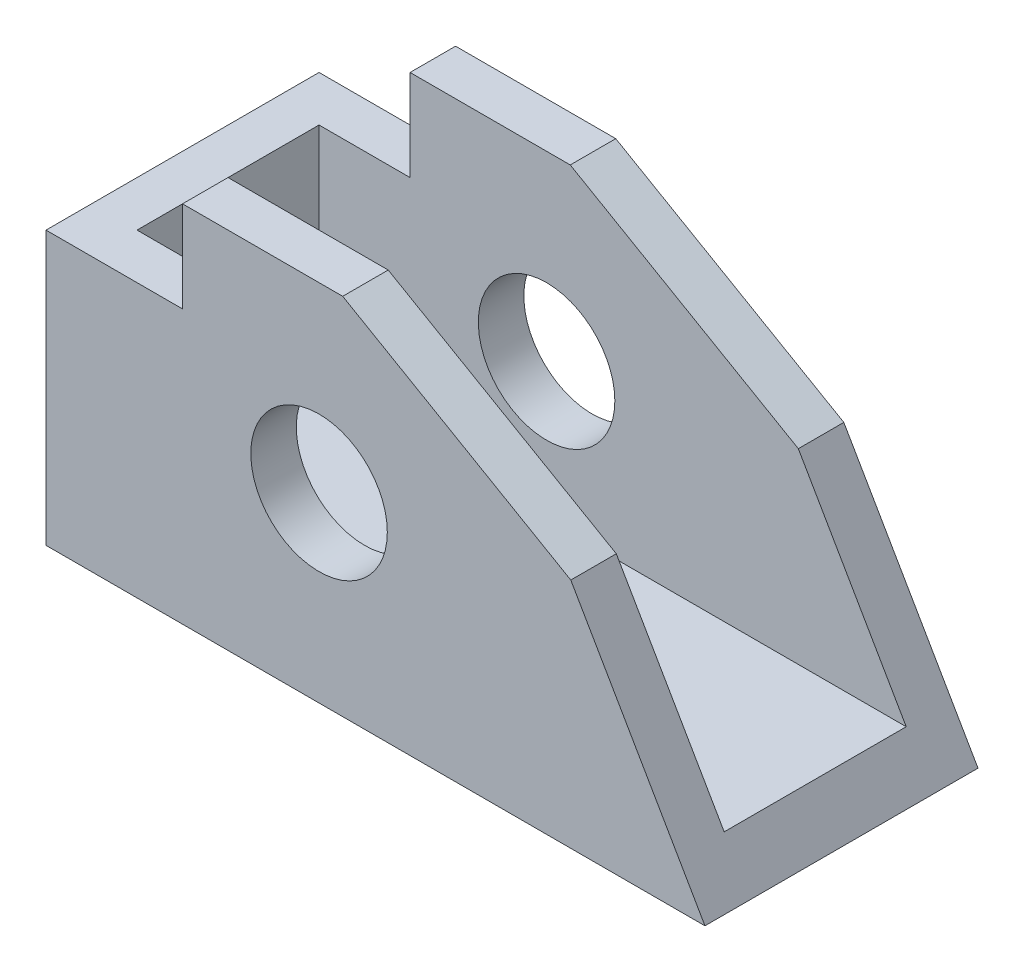
ISO-10303-21;
HEADER;
FILE_DESCRIPTION(('STEP AP214'),'2;1');
FILE_NAME('part.step','',(''),(''),'','','');
FILE_SCHEMA(('AUTOMOTIVE_DESIGN { 1 0 10303 214 1 1 1 1 }'));
ENDSEC;
DATA;
#1=APPLICATION_CONTEXT('core data for automotive mechanical design processes');
#2=APPLICATION_PROTOCOL_DEFINITION('international standard','automotive_design',2000,#1);
#3=PRODUCT_CONTEXT('',#1,'mechanical');
#4=PRODUCT('Part','Part','',(#3));
#5=PRODUCT_RELATED_PRODUCT_CATEGORY('part','',(#4));
#6=PRODUCT_DEFINITION_FORMATION('','',#4);
#7=PRODUCT_DEFINITION_CONTEXT('part definition',#1,'design');
#8=PRODUCT_DEFINITION('design','',#6,#7);
#9=PRODUCT_DEFINITION_SHAPE('','',#8);
#10=(LENGTH_UNIT() NAMED_UNIT(*) SI_UNIT(.MILLI.,.METRE.));
#11=(NAMED_UNIT(*) PLANE_ANGLE_UNIT() SI_UNIT($,.RADIAN.));
#12=(NAMED_UNIT(*) SI_UNIT($,.STERADIAN.) SOLID_ANGLE_UNIT());
#13=UNCERTAINTY_MEASURE_WITH_UNIT(LENGTH_MEASURE(1.E-05),#10,'distance_accuracy_value','');
#14=(GEOMETRIC_REPRESENTATION_CONTEXT(3) GLOBAL_UNCERTAINTY_ASSIGNED_CONTEXT((#13)) GLOBAL_UNIT_ASSIGNED_CONTEXT((#10,
#11,#12)) REPRESENTATION_CONTEXT('',''));
#15=CARTESIAN_POINT('',(0.,0.,0.));
#16=DIRECTION('',(0.,0.,1.));
#17=DIRECTION('',(1.,0.,0.));
#18=AXIS2_PLACEMENT_3D('',#15,#16,#17);
#19=CARTESIAN_POINT('',(0.,50.8,0.));
#20=DIRECTION('',(0.,1.,0.));
#21=DIRECTION('',(0.,0.,1.));
#22=AXIS2_PLACEMENT_3D('',#19,#20,#21);
#23=PLANE('',#22);
#24=DIRECTION('',(0.,0.,1.));
#25=VECTOR('',#24,1.);
#26=CARTESIAN_POINT('',(-48.9494285714286,50.8,-44.7675));
#27=LINE('',#26,#25);
#28=CARTESIAN_POINT('',(-48.9494285714286,50.8,-13.0175));
#29=VERTEX_POINT('',#28);
#30=CARTESIAN_POINT('',(-48.9494285714286,50.8,-6.66749999999999));
#31=VERTEX_POINT('',#30);
#32=EDGE_CURVE('E162',#29,#31,#27,.T.);
#33=ORIENTED_EDGE('',*,*,#32,.F.);
#34=DIRECTION('',(1.,0.,0.));
#35=VECTOR('',#34,1.);
#36=CARTESIAN_POINT('',(-84.0014285714286,50.8,-13.0175));
#37=LINE('',#36,#35);
#38=CARTESIAN_POINT('',(-71.3014285714286,50.8,-13.0175));
#39=VERTEX_POINT('',#38);
#40=EDGE_CURVE('E183',#39,#29,#37,.T.);
#41=ORIENTED_EDGE('',*,*,#40,.F.);
#42=DIRECTION('',(0.,0.,1.));
#43=VECTOR('',#42,1.);
#44=CARTESIAN_POINT('',(-71.3014285714286,50.8,-44.7675));
#45=LINE('',#44,#43);
#46=CARTESIAN_POINT('',(-71.3014285714286,50.8,-6.66749999999999));
#47=VERTEX_POINT('',#46);
#48=EDGE_CURVE('E235',#39,#47,#45,.T.);
#49=ORIENTED_EDGE('',*,*,#48,.T.);
#50=DIRECTION('',(1.,0.,0.));
#51=VECTOR('',#50,1.);
#52=CARTESIAN_POINT('',(-90.3514285714286,50.8,-6.66749999999999));
#53=LINE('',#52,#51);
#54=EDGE_CURVE('E170',#47,#31,#53,.T.);
#55=ORIENTED_EDGE('',*,*,#54,.T.);
#56=EDGE_LOOP('',(#33,#41,#49,#55));
#57=FACE_BOUND('',#56,.T.);
#58=ADVANCED_FACE('F38',(#57),#23,.T.);
#59=CARTESIAN_POINT('',(-90.3514285714286,50.8,-44.7675));
#60=DIRECTION('',(1.,0.,0.));
#61=DIRECTION('',(0.,0.,-1.));
#62=AXIS2_PLACEMENT_3D('',#59,#60,#61);
#63=PLANE('',#62);
#64=DIRECTION('',(0.,-1.,0.));
#65=VECTOR('',#64,1.);
#66=CARTESIAN_POINT('',(-90.3514285714286,50.8,-6.66749999999999));
#67=LINE('',#66,#65);
#68=CARTESIAN_POINT('',(-90.3514285714286,38.1,-6.66749999999999));
#69=VERTEX_POINT('',#68);
#70=CARTESIAN_POINT('',(-90.3514285714286,0.,-6.66749999999999));
#71=VERTEX_POINT('',#70);
#72=EDGE_CURVE('E172',#69,#71,#67,.T.);
#73=ORIENTED_EDGE('',*,*,#72,.F.);
#74=DIRECTION('',(0.,0.,1.));
#75=VECTOR('',#74,1.);
#76=CARTESIAN_POINT('',(-90.3514285714286,38.1,-44.7675));
#77=LINE('',#76,#75);
#78=CARTESIAN_POINT('',(-90.3514285714286,38.1,-44.7675));
#79=VERTEX_POINT('',#78);
#80=EDGE_CURVE('E229',#79,#69,#77,.T.);
#81=ORIENTED_EDGE('',*,*,#80,.F.);
#82=DIRECTION('',(0.,-1.,0.));
#83=VECTOR('',#82,1.);
#84=CARTESIAN_POINT('',(-90.3514285714286,50.8,-44.7675));
#85=LINE('',#84,#83);
#86=CARTESIAN_POINT('',(-90.3514285714286,0.,-44.7675));
#87=VERTEX_POINT('',#86);
#88=EDGE_CURVE('E169',#79,#87,#85,.T.);
#89=ORIENTED_EDGE('',*,*,#88,.T.);
#90=DIRECTION('',(0.,0.,1.));
#91=VECTOR('',#90,1.);
#92=CARTESIAN_POINT('',(-90.3514285714286,0.,-44.7675));
#93=LINE('',#92,#91);
#94=EDGE_CURVE('E179',#87,#71,#93,.T.);
#95=ORIENTED_EDGE('',*,*,#94,.T.);
#96=EDGE_LOOP('',(#73,#81,#89,#95));
#97=FACE_BOUND('',#96,.T.);
#98=ADVANCED_FACE('F40',(#97),#63,.F.);
#99=CARTESIAN_POINT('',(-90.3514285714286,50.8,-6.66749999999999));
#100=DIRECTION('',(0.,0.,-1.));
#101=DIRECTION('',(-1.,0.,0.));
#102=AXIS2_PLACEMENT_3D('',#99,#100,#101);
#103=PLANE('',#102);
#104=CARTESIAN_POINT('',(-52.2514285714286,25.4,-6.66749999999999));
#105=DIRECTION('',(0.,0.,1.));
#106=DIRECTION('',(1.,0.,0.));
#107=AXIS2_PLACEMENT_3D('',#104,#105,#106);
#108=CIRCLE('',#107,9.525);
#109=CARTESIAN_POINT('',(-42.7264285714286,25.4,-6.66749999999999));
#110=VERTEX_POINT('',#109);
#111=EDGE_CURVE('E260',#110,#110,#108,.T.);
#112=ORIENTED_EDGE('',*,*,#111,.F.);
#113=EDGE_LOOP('',(#112));
#114=FACE_BOUND('',#113,.T.);
#115=DIRECTION('',(1.,0.,0.));
#116=VECTOR('',#115,1.);
#117=CARTESIAN_POINT('',(-90.3514285714286,0.,-6.66749999999999));
#118=LINE('',#117,#116);
#119=CARTESIAN_POINT('',(1.59657142857142,0.,-6.66749999999999));
#120=VERTEX_POINT('',#119);
#121=EDGE_CURVE('E182',#71,#120,#118,.T.);
#122=ORIENTED_EDGE('',*,*,#121,.T.);
#123=DIRECTION('',(0.500000000000004,-0.866025403784436,0.));
#124=VECTOR('',#123,1.);
#125=CARTESIAN_POINT('',(1.59657142857142,0.,-6.66749999999999));
#126=LINE('',#125,#124);
#127=CARTESIAN_POINT('',(-17.1245190836786,32.4258799403123,-6.66749999999999));
#128=VERTEX_POINT('',#127);
#129=EDGE_CURVE('E151',#128,#120,#126,.T.);
#130=ORIENTED_EDGE('',*,*,#129,.F.);
#131=DIRECTION('',(0.866025403784442,-0.499999999999995,0.));
#132=VECTOR('',#131,1.);
#133=CARTESIAN_POINT('',(-17.1245190836786,32.4258799403123,-6.66749999999999));
#134=LINE('',#133,#132);
#135=EDGE_CURVE('E253',#31,#128,#134,.T.);
#136=ORIENTED_EDGE('',*,*,#135,.F.);
#137=ORIENTED_EDGE('',*,*,#54,.F.);
#138=DIRECTION('',(0.,1.,0.));
#139=VECTOR('',#138,1.);
#140=CARTESIAN_POINT('',(-71.3014285714286,50.8,-6.66749999999999));
#141=LINE('',#140,#139);
#142=CARTESIAN_POINT('',(-71.3014285714286,38.1,-6.66749999999999));
#143=VERTEX_POINT('',#142);
#144=EDGE_CURVE('E237',#143,#47,#141,.T.);
#145=ORIENTED_EDGE('',*,*,#144,.F.);
#146=DIRECTION('',(1.,0.,0.));
#147=VECTOR('',#146,1.);
#148=CARTESIAN_POINT('',(-90.3514285714286,38.1,-6.66749999999999));
#149=LINE('',#148,#147);
#150=EDGE_CURVE('E240',#69,#143,#149,.T.);
#151=ORIENTED_EDGE('',*,*,#150,.F.);
#152=ORIENTED_EDGE('',*,*,#72,.T.);
#153=EDGE_LOOP('',(#122,#130,#136,#137,#145,#151,#152));
#154=FACE_BOUND('',#153,.T.);
#155=ADVANCED_FACE('F289',(#114,#154),#103,.F.);
#156=CARTESIAN_POINT('',(-90.3514285714286,50.8,-44.7675));
#157=DIRECTION('',(0.,0.,1.));
#158=DIRECTION('',(1.,0.,0.));
#159=AXIS2_PLACEMENT_3D('',#156,#157,#158);
#160=PLANE('',#159);
#161=CARTESIAN_POINT('',(-52.2514285714286,25.4,-44.7675));
#162=DIRECTION('',(0.,0.,1.));
#163=DIRECTION('',(1.,0.,0.));
#164=AXIS2_PLACEMENT_3D('',#161,#162,#163);
#165=CIRCLE('',#164,9.525);
#166=CARTESIAN_POINT('',(-42.7264285714286,25.4,-44.7675));
#167=VERTEX_POINT('',#166);
#168=EDGE_CURVE('E263',#167,#167,#165,.T.);
#169=ORIENTED_EDGE('',*,*,#168,.T.);
#170=EDGE_LOOP('',(#169));
#171=FACE_BOUND('',#170,.T.);
#172=DIRECTION('',(0.866025403784442,-0.499999999999995,0.));
#173=VECTOR('',#172,1.);
#174=CARTESIAN_POINT('',(-17.1245190836786,32.4258799403123,-44.7675));
#175=LINE('',#174,#173);
#176=CARTESIAN_POINT('',(-48.9494285714286,50.8,-44.7675));
#177=VERTEX_POINT('',#176);
#178=CARTESIAN_POINT('',(-17.1245190836786,32.4258799403123,-44.7675));
#179=VERTEX_POINT('',#178);
#180=EDGE_CURVE('E141',#177,#179,#175,.T.);
#181=ORIENTED_EDGE('',*,*,#180,.T.);
#182=DIRECTION('',(0.500000000000004,-0.866025403784436,0.));
#183=VECTOR('',#182,1.);
#184=CARTESIAN_POINT('',(1.59657142857142,0.,-44.7675));
#185=LINE('',#184,#183);
#186=CARTESIAN_POINT('',(1.59657142857142,0.,-44.7675));
#187=VERTEX_POINT('',#186);
#188=EDGE_CURVE('E150',#179,#187,#185,.T.);
#189=ORIENTED_EDGE('',*,*,#188,.T.);
#190=DIRECTION('',(-1.,0.,0.));
#191=VECTOR('',#190,1.);
#192=CARTESIAN_POINT('',(-90.3514285714286,0.,-44.7675));
#193=LINE('',#192,#191);
#194=EDGE_CURVE('E175',#187,#87,#193,.T.);
#195=ORIENTED_EDGE('',*,*,#194,.T.);
#196=ORIENTED_EDGE('',*,*,#88,.F.);
#197=DIRECTION('',(1.,0.,0.));
#198=VECTOR('',#197,1.);
#199=CARTESIAN_POINT('',(-90.3514285714286,38.1,-44.7675));
#200=LINE('',#199,#198);
#201=CARTESIAN_POINT('',(-71.3014285714286,38.1,-44.7675));
#202=VERTEX_POINT('',#201);
#203=EDGE_CURVE('E239',#79,#202,#200,.T.);
#204=ORIENTED_EDGE('',*,*,#203,.T.);
#205=DIRECTION('',(0.,1.,0.));
#206=VECTOR('',#205,1.);
#207=CARTESIAN_POINT('',(-71.3014285714286,50.8,-44.7675));
#208=LINE('',#207,#206);
#209=CARTESIAN_POINT('',(-71.3014285714286,50.8,-44.7675));
#210=VERTEX_POINT('',#209);
#211=EDGE_CURVE('E168',#202,#210,#208,.T.);
#212=ORIENTED_EDGE('',*,*,#211,.T.);
#213=DIRECTION('',(-1.,0.,0.));
#214=VECTOR('',#213,1.);
#215=CARTESIAN_POINT('',(-90.3514285714286,50.8,-44.7675));
#216=LINE('',#215,#214);
#217=EDGE_CURVE('E157',#177,#210,#216,.T.);
#218=ORIENTED_EDGE('',*,*,#217,.F.);
#219=EDGE_LOOP('',(#181,#189,#195,#196,#204,#212,#218));
#220=FACE_BOUND('',#219,.T.);
#221=ADVANCED_FACE('F165',(#171,#220),#160,.F.);
#222=CARTESIAN_POINT('',(-48.9494285714286,50.8,-38.4175));
#223=VERTEX_POINT('',#222);
#224=EDGE_CURVE('E144',#177,#223,#27,.T.);
#225=ORIENTED_EDGE('',*,*,#224,.F.);
#226=ORIENTED_EDGE('',*,*,#217,.T.);
#227=CARTESIAN_POINT('',(-71.3014285714286,50.8,-38.4175));
#228=VERTEX_POINT('',#227);
#229=EDGE_CURVE('E228',#210,#228,#45,.T.);
#230=ORIENTED_EDGE('',*,*,#229,.T.);
#231=DIRECTION('',(1.,0.,0.));
#232=VECTOR('',#231,1.);
#233=CARTESIAN_POINT('',(-84.0014285714286,50.8,-38.4175));
#234=LINE('',#233,#232);
#235=EDGE_CURVE('E160',#228,#223,#234,.T.);
#236=ORIENTED_EDGE('',*,*,#235,.T.);
#237=EDGE_LOOP('',(#225,#226,#230,#236));
#238=FACE_BOUND('',#237,.T.);
#239=ADVANCED_FACE('F155',(#238),#23,.T.);
#240=CARTESIAN_POINT('',(0.,0.,0.));
#241=DIRECTION('',(0.,1.,0.));
#242=DIRECTION('',(0.,0.,1.));
#243=AXIS2_PLACEMENT_3D('',#240,#241,#242);
#244=PLANE('',#243);
#245=ORIENTED_EDGE('',*,*,#94,.F.);
#246=ORIENTED_EDGE('',*,*,#194,.F.);
#247=DIRECTION('',(0.,0.,-1.));
#248=VECTOR('',#247,1.);
#249=CARTESIAN_POINT('',(1.59657142857142,0.,-44.7675));
#250=LINE('',#249,#248);
#251=EDGE_CURVE('E186',#120,#187,#250,.T.);
#252=ORIENTED_EDGE('',*,*,#251,.F.);
#253=ORIENTED_EDGE('',*,*,#121,.F.);
#254=EDGE_LOOP('',(#245,#246,#252,#253));
#255=FACE_BOUND('',#254,.T.);
#256=ADVANCED_FACE('F295',(#255),#244,.F.);
#257=CARTESIAN_POINT('',(-84.0014285714286,50.8,-13.0175));
#258=DIRECTION('',(0.,0.,1.));
#259=DIRECTION('',(0.,-1.,0.));
#260=AXIS2_PLACEMENT_3D('',#257,#258,#259);
#261=PLANE('',#260);
#262=CARTESIAN_POINT('',(-52.2514285714286,25.4,-13.0175));
#263=DIRECTION('',(0.,0.,1.));
#264=DIRECTION('',(0.,-1.,0.));
#265=AXIS2_PLACEMENT_3D('',#262,#263,#264);
#266=CIRCLE('',#265,9.525);
#267=CARTESIAN_POINT('',(-52.2514285714286,15.875,-13.0175));
#268=VERTEX_POINT('',#267);
#269=EDGE_CURVE('E256',#268,#268,#266,.T.);
#270=ORIENTED_EDGE('',*,*,#269,.T.);
#271=EDGE_LOOP('',(#270));
#272=FACE_BOUND('',#271,.T.);
#273=DIRECTION('',(0.866025403784442,-0.499999999999995,0.));
#274=VECTOR('',#273,1.);
#275=CARTESIAN_POINT('',(-75.2384285714288,65.977961226726,-13.0175));
#276=LINE('',#275,#274);
#277=CARTESIAN_POINT('',(-17.1245190836786,32.4258799403123,-13.0175));
#278=VERTEX_POINT('',#277);
#279=EDGE_CURVE('E243',#29,#278,#276,.T.);
#280=ORIENTED_EDGE('',*,*,#279,.T.);
#281=DIRECTION('',(0.500000000000004,-0.866025403784436,0.));
#282=VECTOR('',#281,1.);
#283=CARTESIAN_POINT('',(-41.7999738275538,75.1650212565702,-13.0175));
#284=LINE('',#283,#282);
#285=CARTESIAN_POINT('',(-2.06960278078275,6.35,-13.0175));
#286=VERTEX_POINT('',#285);
#287=EDGE_CURVE('E248',#278,#286,#284,.T.);
#288=ORIENTED_EDGE('',*,*,#287,.T.);
#289=DIRECTION('',(1.,0.,0.));
#290=VECTOR('',#289,1.);
#291=CARTESIAN_POINT('',(-84.0014285714286,6.35,-13.0175));
#292=LINE('',#291,#290);
#293=CARTESIAN_POINT('',(-84.0014285714286,6.35,-13.0175));
#294=VERTEX_POINT('',#293);
#295=EDGE_CURVE('E204',#294,#286,#292,.T.);
#296=ORIENTED_EDGE('',*,*,#295,.F.);
#297=DIRECTION('',(0.,-1.,0.));
#298=VECTOR('',#297,1.);
#299=CARTESIAN_POINT('',(-84.0014285714286,50.8,-13.0175));
#300=LINE('',#299,#298);
#301=CARTESIAN_POINT('',(-84.0014285714286,38.1,-13.0175));
#302=VERTEX_POINT('',#301);
#303=EDGE_CURVE('E220',#302,#294,#300,.T.);
#304=ORIENTED_EDGE('',*,*,#303,.F.);
#305=DIRECTION('',(1.,0.,0.));
#306=VECTOR('',#305,1.);
#307=CARTESIAN_POINT('',(-84.0014285714286,38.1,-13.0175));
#308=LINE('',#307,#306);
#309=CARTESIAN_POINT('',(-71.3014285714286,38.1,-13.0175));
#310=VERTEX_POINT('',#309);
#311=EDGE_CURVE('E62',#302,#310,#308,.T.);
#312=ORIENTED_EDGE('',*,*,#311,.T.);
#313=DIRECTION('',(0.,1.,0.));
#314=VECTOR('',#313,1.);
#315=CARTESIAN_POINT('',(-71.3014285714286,50.8,-13.0175));
#316=LINE('',#315,#314);
#317=EDGE_CURVE('E222',#310,#39,#316,.T.);
#318=ORIENTED_EDGE('',*,*,#317,.T.);
#319=ORIENTED_EDGE('',*,*,#40,.T.);
#320=EDGE_LOOP('',(#280,#288,#296,#304,#312,#318,#319));
#321=FACE_BOUND('',#320,.T.);
#322=ADVANCED_FACE('F300',(#272,#321),#261,.F.);
#323=CARTESIAN_POINT('',(-84.0014285714286,50.8,-38.4175));
#324=DIRECTION('',(0.,0.,-1.));
#325=DIRECTION('',(0.,1.,0.));
#326=AXIS2_PLACEMENT_3D('',#323,#324,#325);
#327=PLANE('',#326);
#328=CARTESIAN_POINT('',(-52.2514285714286,25.4,-38.4175));
#329=DIRECTION('',(0.,0.,-1.));
#330=DIRECTION('',(0.,1.,0.));
#331=AXIS2_PLACEMENT_3D('',#328,#329,#330);
#332=CIRCLE('',#331,9.525);
#333=CARTESIAN_POINT('',(-52.2514285714286,34.925,-38.4175));
#334=VERTEX_POINT('',#333);
#335=EDGE_CURVE('E42',#334,#334,#332,.T.);
#336=ORIENTED_EDGE('',*,*,#335,.T.);
#337=EDGE_LOOP('',(#336));
#338=FACE_BOUND('',#337,.T.);
#339=DIRECTION('',(1.,0.,0.));
#340=VECTOR('',#339,1.);
#341=CARTESIAN_POINT('',(-84.0014285714286,6.35,-38.4175));
#342=LINE('',#341,#340);
#343=CARTESIAN_POINT('',(-84.0014285714286,6.35,-38.4175));
#344=VERTEX_POINT('',#343);
#345=CARTESIAN_POINT('',(-2.06960278078275,6.35,-38.4175));
#346=VERTEX_POINT('',#345);
#347=EDGE_CURVE('E201',#344,#346,#342,.T.);
#348=ORIENTED_EDGE('',*,*,#347,.T.);
#349=DIRECTION('',(-0.500000000000004,0.866025403784436,0.));
#350=VECTOR('',#349,1.);
#351=CARTESIAN_POINT('',(-41.7999738275538,75.1650212565702,-38.4175));
#352=LINE('',#351,#350);
#353=CARTESIAN_POINT('',(-17.1245190836786,32.4258799403123,-38.4175));
#354=VERTEX_POINT('',#353);
#355=EDGE_CURVE('E54',#346,#354,#352,.T.);
#356=ORIENTED_EDGE('',*,*,#355,.T.);
#357=DIRECTION('',(-0.866025403784442,0.499999999999995,0.));
#358=VECTOR('',#357,1.);
#359=CARTESIAN_POINT('',(-75.2384285714288,65.977961226726,-38.4175));
#360=LINE('',#359,#358);
#361=EDGE_CURVE('E11',#354,#223,#360,.T.);
#362=ORIENTED_EDGE('',*,*,#361,.T.);
#363=ORIENTED_EDGE('',*,*,#235,.F.);
#364=DIRECTION('',(0.,-1.,0.));
#365=VECTOR('',#364,1.);
#366=CARTESIAN_POINT('',(-71.3014285714286,50.8,-38.4175));
#367=LINE('',#366,#365);
#368=CARTESIAN_POINT('',(-71.3014285714286,38.1,-38.4175));
#369=VERTEX_POINT('',#368);
#370=EDGE_CURVE('E193',#228,#369,#367,.T.);
#371=ORIENTED_EDGE('',*,*,#370,.T.);
#372=DIRECTION('',(-1.,0.,0.));
#373=VECTOR('',#372,1.);
#374=CARTESIAN_POINT('',(-84.0014285714286,38.1,-38.4175));
#375=LINE('',#374,#373);
#376=CARTESIAN_POINT('',(-84.0014285714286,38.1,-38.4175));
#377=VERTEX_POINT('',#376);
#378=EDGE_CURVE('E226',#369,#377,#375,.T.);
#379=ORIENTED_EDGE('',*,*,#378,.T.);
#380=DIRECTION('',(0.,1.,0.));
#381=VECTOR('',#380,1.);
#382=CARTESIAN_POINT('',(-84.0014285714286,50.8,-38.4175));
#383=LINE('',#382,#381);
#384=EDGE_CURVE('E210',#344,#377,#383,.T.);
#385=ORIENTED_EDGE('',*,*,#384,.F.);
#386=EDGE_LOOP('',(#348,#356,#362,#363,#371,#379,#385));
#387=FACE_BOUND('',#386,.T.);
#388=ADVANCED_FACE('F207',(#338,#387),#327,.F.);
#389=CARTESIAN_POINT('',(-84.0014285714286,6.35,-13.0175));
#390=DIRECTION('',(0.,-1.,0.));
#391=DIRECTION('',(0.,0.,-1.));
#392=AXIS2_PLACEMENT_3D('',#389,#390,#391);
#393=PLANE('',#392);
#394=ORIENTED_EDGE('',*,*,#295,.T.);
#395=DIRECTION('',(0.,0.,-1.));
#396=VECTOR('',#395,1.);
#397=CARTESIAN_POINT('',(-2.06960278078275,6.35,-13.0175));
#398=LINE('',#397,#396);
#399=EDGE_CURVE('E47',#286,#346,#398,.T.);
#400=ORIENTED_EDGE('',*,*,#399,.T.);
#401=ORIENTED_EDGE('',*,*,#347,.F.);
#402=DIRECTION('',(0.,0.,-1.));
#403=VECTOR('',#402,1.);
#404=CARTESIAN_POINT('',(-84.0014285714286,6.35,-13.0175));
#405=LINE('',#404,#403);
#406=EDGE_CURVE('E218',#294,#344,#405,.T.);
#407=ORIENTED_EDGE('',*,*,#406,.F.);
#408=EDGE_LOOP('',(#394,#400,#401,#407));
#409=FACE_BOUND('',#408,.T.);
#410=ADVANCED_FACE('F199',(#409),#393,.F.);
#411=CARTESIAN_POINT('',(-84.0014285714286,0.,0.));
#412=DIRECTION('',(1.,0.,0.));
#413=DIRECTION('',(0.,0.,-1.));
#414=AXIS2_PLACEMENT_3D('',#411,#412,#413);
#415=PLANE('',#414);
#416=DIRECTION('',(0.,0.,-1.));
#417=VECTOR('',#416,1.);
#418=CARTESIAN_POINT('',(-84.0014285714286,38.1,0.));
#419=LINE('',#418,#417);
#420=EDGE_CURVE('E191',#302,#377,#419,.T.);
#421=ORIENTED_EDGE('',*,*,#420,.F.);
#422=ORIENTED_EDGE('',*,*,#303,.T.);
#423=ORIENTED_EDGE('',*,*,#406,.T.);
#424=ORIENTED_EDGE('',*,*,#384,.T.);
#425=EDGE_LOOP('',(#421,#422,#423,#424));
#426=FACE_BOUND('',#425,.T.);
#427=ADVANCED_FACE('F331',(#426),#415,.T.);
#428=CARTESIAN_POINT('',(-71.3014285714286,50.8,-44.7675));
#429=DIRECTION('',(1.,0.,0.));
#430=DIRECTION('',(0.,0.,-1.));
#431=AXIS2_PLACEMENT_3D('',#428,#429,#430);
#432=PLANE('',#431);
#433=DIRECTION('',(0.,0.,1.));
#434=VECTOR('',#433,1.);
#435=CARTESIAN_POINT('',(-71.3014285714286,38.1,-44.7675));
#436=LINE('',#435,#434);
#437=EDGE_CURVE('E231',#310,#143,#436,.T.);
#438=ORIENTED_EDGE('',*,*,#437,.T.);
#439=ORIENTED_EDGE('',*,*,#144,.T.);
#440=ORIENTED_EDGE('',*,*,#48,.F.);
#441=ORIENTED_EDGE('',*,*,#317,.F.);
#442=EDGE_LOOP('',(#438,#439,#440,#441));
#443=FACE_BOUND('',#442,.T.);
#444=ADVANCED_FACE('F326',(#443),#432,.F.);
#445=ORIENTED_EDGE('',*,*,#229,.F.);
#446=ORIENTED_EDGE('',*,*,#211,.F.);
#447=EDGE_CURVE('E232',#202,#369,#436,.T.);
#448=ORIENTED_EDGE('',*,*,#447,.T.);
#449=ORIENTED_EDGE('',*,*,#370,.F.);
#450=EDGE_LOOP('',(#445,#446,#448,#449));
#451=FACE_BOUND('',#450,.T.);
#452=ADVANCED_FACE('F333',(#451),#432,.F.);
#453=CARTESIAN_POINT('',(-90.3514285714286,38.1,-44.7675));
#454=DIRECTION('',(0.,-1.,0.));
#455=DIRECTION('',(0.,0.,-1.));
#456=AXIS2_PLACEMENT_3D('',#453,#454,#455);
#457=PLANE('',#456);
#458=ORIENTED_EDGE('',*,*,#420,.T.);
#459=ORIENTED_EDGE('',*,*,#378,.F.);
#460=ORIENTED_EDGE('',*,*,#447,.F.);
#461=ORIENTED_EDGE('',*,*,#203,.F.);
#462=ORIENTED_EDGE('',*,*,#80,.T.);
#463=ORIENTED_EDGE('',*,*,#150,.T.);
#464=ORIENTED_EDGE('',*,*,#437,.F.);
#465=ORIENTED_EDGE('',*,*,#311,.F.);
#466=EDGE_LOOP('',(#458,#459,#460,#461,#462,#463,#464,#465));
#467=FACE_BOUND('',#466,.T.);
#468=ADVANCED_FACE('F321',(#467),#457,.F.);
#469=CARTESIAN_POINT('',(-17.1245190836786,32.4258799403123,-44.7675));
#470=DIRECTION('',(-0.499999999999995,-0.866025403784442,0.));
#471=DIRECTION('',(0.866025403784442,-0.499999999999995,0.));
#472=AXIS2_PLACEMENT_3D('',#469,#470,#471);
#473=PLANE('',#472);
#474=ORIENTED_EDGE('',*,*,#32,.T.);
#475=ORIENTED_EDGE('',*,*,#135,.T.);
#476=DIRECTION('',(0.,0.,1.));
#477=VECTOR('',#476,1.);
#478=CARTESIAN_POINT('',(-17.1245190836786,32.4258799403123,-44.7675));
#479=LINE('',#478,#477);
#480=EDGE_CURVE('E161',#278,#128,#479,.T.);
#481=ORIENTED_EDGE('',*,*,#480,.F.);
#482=ORIENTED_EDGE('',*,*,#279,.F.);
#483=EDGE_LOOP('',(#474,#475,#481,#482));
#484=FACE_BOUND('',#483,.T.);
#485=ADVANCED_FACE('F340',(#484),#473,.F.);
#486=EDGE_CURVE('E145',#179,#354,#479,.T.);
#487=ORIENTED_EDGE('',*,*,#486,.F.);
#488=ORIENTED_EDGE('',*,*,#180,.F.);
#489=ORIENTED_EDGE('',*,*,#224,.T.);
#490=ORIENTED_EDGE('',*,*,#361,.F.);
#491=EDGE_LOOP('',(#487,#488,#489,#490));
#492=FACE_BOUND('',#491,.T.);
#493=ADVANCED_FACE('F143',(#492),#473,.F.);
#494=CARTESIAN_POINT('',(1.59657142857142,0.,-44.7675));
#495=DIRECTION('',(-0.866025403784436,-0.500000000000004,0.));
#496=DIRECTION('',(0.500000000000004,-0.866025403784436,0.));
#497=AXIS2_PLACEMENT_3D('',#494,#495,#496);
#498=PLANE('',#497);
#499=ORIENTED_EDGE('',*,*,#480,.T.);
#500=ORIENTED_EDGE('',*,*,#129,.T.);
#501=ORIENTED_EDGE('',*,*,#251,.T.);
#502=ORIENTED_EDGE('',*,*,#188,.F.);
#503=ORIENTED_EDGE('',*,*,#486,.T.);
#504=ORIENTED_EDGE('',*,*,#355,.F.);
#505=ORIENTED_EDGE('',*,*,#399,.F.);
#506=ORIENTED_EDGE('',*,*,#287,.F.);
#507=EDGE_LOOP('',(#499,#500,#501,#502,#503,#504,#505,#506));
#508=FACE_BOUND('',#507,.T.);
#509=ADVANCED_FACE('F274',(#508),#498,.F.);
#510=CARTESIAN_POINT('',(-52.2514285714286,25.4,-44.7675));
#511=DIRECTION('',(0.,0.,1.));
#512=DIRECTION('',(1.,0.,0.));
#513=AXIS2_PLACEMENT_3D('',#510,#511,#512);
#514=CYLINDRICAL_SURFACE('',#513,9.525);
#515=ORIENTED_EDGE('',*,*,#168,.F.);
#516=EDGE_LOOP('',(#515));
#517=FACE_BOUND('',#516,.T.);
#518=ORIENTED_EDGE('',*,*,#335,.F.);
#519=EDGE_LOOP('',(#518));
#520=FACE_BOUND('',#519,.T.);
#521=ADVANCED_FACE('F271',(#517,#520),#514,.F.);
#522=ORIENTED_EDGE('',*,*,#111,.T.);
#523=EDGE_LOOP('',(#522));
#524=FACE_BOUND('',#523,.T.);
#525=ORIENTED_EDGE('',*,*,#269,.F.);
#526=EDGE_LOOP('',(#525));
#527=FACE_BOUND('',#526,.T.);
#528=ADVANCED_FACE('F273',(#524,#527),#514,.F.);
#529=CLOSED_SHELL('',(#58,#98,#155,#221,#239,#256,#322,#388,#410,#427,#444,#452,#468,#485,#493,
#509,#521,#528));
#530=MANIFOLD_SOLID_BREP('B2',#529);
#531=ADVANCED_BREP_SHAPE_REPRESENTATION('',(#18,#530),#14);
#532=SHAPE_DEFINITION_REPRESENTATION(#9,#531);
ENDSEC;
END-ISO-10303-21;
